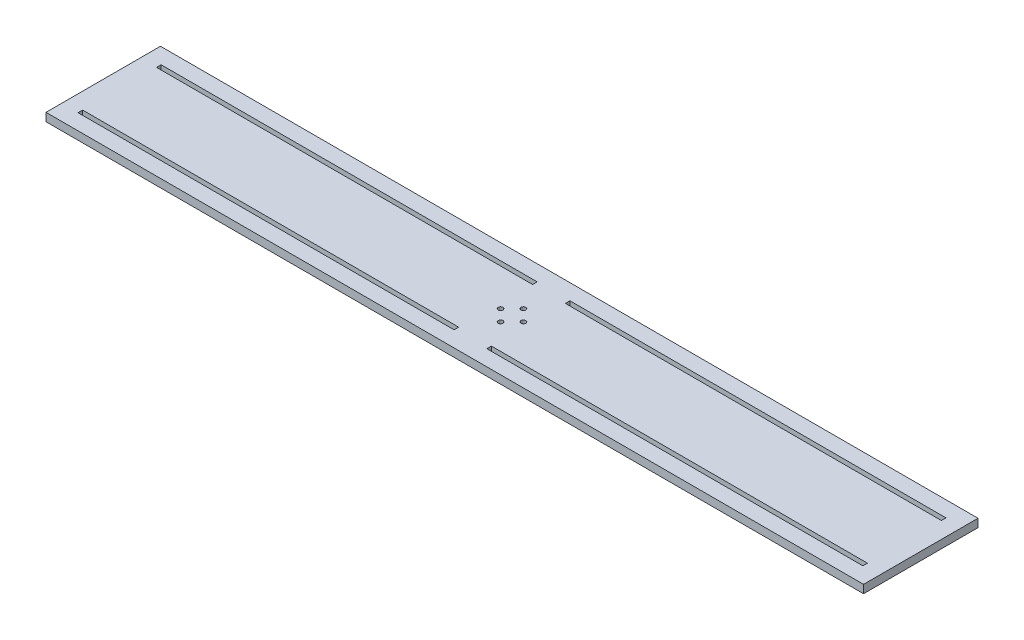
ISO-10303-21;
HEADER;
FILE_DESCRIPTION(('STEP AP214'),'2;1');
FILE_NAME('part.step','',(''),(''),'','','');
FILE_SCHEMA(('AUTOMOTIVE_DESIGN { 1 0 10303 214 1 1 1 1 }'));
ENDSEC;
DATA;
#1=APPLICATION_CONTEXT('core data for automotive mechanical design processes');
#2=APPLICATION_PROTOCOL_DEFINITION('international standard','automotive_design',2000,#1);
#3=PRODUCT_CONTEXT('',#1,'mechanical');
#4=PRODUCT('Part','Part','',(#3));
#5=PRODUCT_RELATED_PRODUCT_CATEGORY('part','',(#4));
#6=PRODUCT_DEFINITION_FORMATION('','',#4);
#7=PRODUCT_DEFINITION_CONTEXT('part definition',#1,'design');
#8=PRODUCT_DEFINITION('design','',#6,#7);
#9=PRODUCT_DEFINITION_SHAPE('','',#8);
#10=(LENGTH_UNIT() NAMED_UNIT(*) SI_UNIT(.MILLI.,.METRE.));
#11=(NAMED_UNIT(*) PLANE_ANGLE_UNIT() SI_UNIT($,.RADIAN.));
#12=(NAMED_UNIT(*) SI_UNIT($,.STERADIAN.) SOLID_ANGLE_UNIT());
#13=UNCERTAINTY_MEASURE_WITH_UNIT(LENGTH_MEASURE(1.E-05),#10,'distance_accuracy_value','');
#14=(GEOMETRIC_REPRESENTATION_CONTEXT(3) GLOBAL_UNCERTAINTY_ASSIGNED_CONTEXT((#13)) GLOBAL_UNIT_ASSIGNED_CONTEXT((#10,
#11,#12)) REPRESENTATION_CONTEXT('',''));
#15=CARTESIAN_POINT('',(0.,0.,0.));
#16=DIRECTION('',(0.,0.,1.));
#17=DIRECTION('',(1.,0.,0.));
#18=AXIS2_PLACEMENT_3D('',#15,#16,#17);
#19=CARTESIAN_POINT('',(0.,2.5,-1131.15981177522));
#20=DIRECTION('',(0.,0.,-1.));
#21=DIRECTION('',(-1.,0.,0.));
#22=AXIS2_PLACEMENT_3D('',#19,#20,#21);
#23=PLANE('',#22);
#24=DIRECTION('',(1.,0.,0.));
#25=VECTOR('',#24,1.);
#26=CARTESIAN_POINT('',(0.,-2.5,-1131.15981177522));
#27=LINE('',#26,#25);
#28=CARTESIAN_POINT('',(147.171720397431,-2.5,-1131.15981177522));
#29=VERTEX_POINT('',#28);
#30=CARTESIAN_POINT('',(647.171720397432,-2.5,-1131.15981177522));
#31=VERTEX_POINT('',#30);
#32=EDGE_CURVE('E262',#29,#31,#27,.T.);
#33=ORIENTED_EDGE('',*,*,#32,.T.);
#34=DIRECTION('',(0.,-1.,0.));
#35=VECTOR('',#34,1.);
#36=CARTESIAN_POINT('',(647.171720397432,2.5,-1131.15981177522));
#37=LINE('',#36,#35);
#38=CARTESIAN_POINT('',(647.171720397432,2.5,-1131.15981177522));
#39=VERTEX_POINT('',#38);
#40=EDGE_CURVE('E11',#39,#31,#37,.T.);
#41=ORIENTED_EDGE('',*,*,#40,.F.);
#42=DIRECTION('',(1.,0.,0.));
#43=VECTOR('',#42,1.);
#44=CARTESIAN_POINT('',(0.,2.5,-1131.15981177522));
#45=LINE('',#44,#43);
#46=CARTESIAN_POINT('',(147.171720397431,2.5,-1131.15981177522));
#47=VERTEX_POINT('',#46);
#48=EDGE_CURVE('E185',#47,#39,#45,.T.);
#49=ORIENTED_EDGE('',*,*,#48,.F.);
#50=DIRECTION('',(0.,-1.,0.));
#51=VECTOR('',#50,1.);
#52=CARTESIAN_POINT('',(147.171720397431,2.5,-1131.15981177522));
#53=LINE('',#52,#51);
#54=EDGE_CURVE('E53',#47,#29,#53,.T.);
#55=ORIENTED_EDGE('',*,*,#54,.T.);
#56=EDGE_LOOP('',(#33,#41,#49,#55));
#57=FACE_BOUND('',#56,.T.);
#58=ADVANCED_FACE('F34',(#57),#23,.F.);
#59=CARTESIAN_POINT('',(647.171720397633,2.5,-1.14960791179474E-10));
#60=DIRECTION('',(-1.,0.,1.77635683940021E-13));
#61=DIRECTION('',(1.77635683940021E-13,0.,1.));
#62=AXIS2_PLACEMENT_3D('',#59,#60,#61);
#63=PLANE('',#62);
#64=DIRECTION('',(-1.77635683940021E-13,0.,-1.));
#65=VECTOR('',#64,1.);
#66=CARTESIAN_POINT('',(647.171720397633,-2.5,-1.14960791179474E-10));
#67=LINE('',#66,#65);
#68=CARTESIAN_POINT('',(647.171720397432,-2.5,-1201.15981177522));
#69=VERTEX_POINT('',#68);
#70=EDGE_CURVE('E191',#31,#69,#67,.T.);
#71=ORIENTED_EDGE('',*,*,#70,.T.);
#72=DIRECTION('',(0.,-1.,0.));
#73=VECTOR('',#72,1.);
#74=CARTESIAN_POINT('',(647.171720397432,2.5,-1201.15981177522));
#75=LINE('',#74,#73);
#76=CARTESIAN_POINT('',(647.171720397432,2.5,-1201.15981177522));
#77=VERTEX_POINT('',#76);
#78=EDGE_CURVE('E44',#77,#69,#75,.T.);
#79=ORIENTED_EDGE('',*,*,#78,.F.);
#80=DIRECTION('',(-1.77635683940021E-13,0.,-1.));
#81=VECTOR('',#80,1.);
#82=CARTESIAN_POINT('',(647.171720397633,2.5,-1.14960791179474E-10));
#83=LINE('',#82,#81);
#84=EDGE_CURVE('E179',#39,#77,#83,.T.);
#85=ORIENTED_EDGE('',*,*,#84,.F.);
#86=ORIENTED_EDGE('',*,*,#40,.T.);
#87=EDGE_LOOP('',(#71,#79,#85,#86));
#88=FACE_BOUND('',#87,.T.);
#89=ADVANCED_FACE('F190',(#88),#63,.F.);
#90=CARTESIAN_POINT('',(0.,2.5,-1201.15981177522));
#91=DIRECTION('',(0.,0.,-1.));
#92=DIRECTION('',(-1.,0.,0.));
#93=AXIS2_PLACEMENT_3D('',#90,#91,#92);
#94=PLANE('',#93);
#95=DIRECTION('',(1.,0.,0.));
#96=VECTOR('',#95,1.);
#97=CARTESIAN_POINT('',(0.,-2.5,-1201.15981177522));
#98=LINE('',#97,#96);
#99=CARTESIAN_POINT('',(147.171720397431,-2.5,-1201.15981177522));
#100=VERTEX_POINT('',#99);
#101=EDGE_CURVE('E265',#100,#69,#98,.T.);
#102=ORIENTED_EDGE('',*,*,#101,.F.);
#103=DIRECTION('',(0.,-1.,0.));
#104=VECTOR('',#103,1.);
#105=CARTESIAN_POINT('',(147.171720397431,2.5,-1201.15981177522));
#106=LINE('',#105,#104);
#107=CARTESIAN_POINT('',(147.171720397431,2.5,-1201.15981177522));
#108=VERTEX_POINT('',#107);
#109=EDGE_CURVE('E115',#108,#100,#106,.T.);
#110=ORIENTED_EDGE('',*,*,#109,.F.);
#111=DIRECTION('',(1.,0.,0.));
#112=VECTOR('',#111,1.);
#113=CARTESIAN_POINT('',(0.,2.5,-1201.15981177522));
#114=LINE('',#113,#112);
#115=EDGE_CURVE('E184',#108,#77,#114,.T.);
#116=ORIENTED_EDGE('',*,*,#115,.T.);
#117=ORIENTED_EDGE('',*,*,#78,.T.);
#118=EDGE_LOOP('',(#102,#110,#116,#117));
#119=FACE_BOUND('',#118,.T.);
#120=ADVANCED_FACE('F195',(#119),#94,.T.);
#121=CARTESIAN_POINT('',(387.171720397431,2.5,0.));
#122=DIRECTION('',(-1.,0.,0.));
#123=DIRECTION('',(0.,0.,1.));
#124=AXIS2_PLACEMENT_3D('',#121,#122,#123);
#125=PLANE('',#124);
#126=DIRECTION('',(0.,0.,-1.));
#127=VECTOR('',#126,1.);
#128=CARTESIAN_POINT('',(387.171720397431,-2.5,0.));
#129=LINE('',#128,#127);
#130=CARTESIAN_POINT('',(387.171720397431,-2.5,-1140.75981177522));
#131=VERTEX_POINT('',#130);
#132=CARTESIAN_POINT('',(387.171720397431,-2.5,-1143.55981177522));
#133=VERTEX_POINT('',#132);
#134=EDGE_CURVE('E250',#131,#133,#129,.T.);
#135=ORIENTED_EDGE('',*,*,#134,.F.);
#136=DIRECTION('',(0.,-1.,0.));
#137=VECTOR('',#136,1.);
#138=CARTESIAN_POINT('',(387.171720397431,2.5,-1140.75981177522));
#139=LINE('',#138,#137);
#140=CARTESIAN_POINT('',(387.171720397431,2.5,-1140.75981177522));
#141=VERTEX_POINT('',#140);
#142=EDGE_CURVE('E272',#141,#131,#139,.T.);
#143=ORIENTED_EDGE('',*,*,#142,.F.);
#144=DIRECTION('',(0.,0.,-1.));
#145=VECTOR('',#144,1.);
#146=CARTESIAN_POINT('',(387.171720397431,2.5,0.));
#147=LINE('',#146,#145);
#148=CARTESIAN_POINT('',(387.171720397431,2.5,-1143.55981177522));
#149=VERTEX_POINT('',#148);
#150=EDGE_CURVE('E618',#141,#149,#147,.T.);
#151=ORIENTED_EDGE('',*,*,#150,.T.);
#152=DIRECTION('',(0.,-1.,0.));
#153=VECTOR('',#152,1.);
#154=CARTESIAN_POINT('',(387.171720397431,2.5,-1143.55981177522));
#155=LINE('',#154,#153);
#156=EDGE_CURVE('E274',#149,#133,#155,.T.);
#157=ORIENTED_EDGE('',*,*,#156,.T.);
#158=EDGE_LOOP('',(#135,#143,#151,#157));
#159=FACE_BOUND('',#158,.T.);
#160=ADVANCED_FACE('F353',(#159),#125,.T.);
#161=CARTESIAN_POINT('',(0.,2.5,-1140.75981177522));
#162=DIRECTION('',(0.,0.,-1.));
#163=DIRECTION('',(-1.,0.,0.));
#164=AXIS2_PLACEMENT_3D('',#161,#162,#163);
#165=PLANE('',#164);
#166=DIRECTION('',(1.,0.,0.));
#167=VECTOR('',#166,1.);
#168=CARTESIAN_POINT('',(0.,-2.5,-1140.75981177522));
#169=LINE('',#168,#167);
#170=CARTESIAN_POINT('',(157.171720397431,-2.5,-1140.75981177522));
#171=VERTEX_POINT('',#170);
#172=EDGE_CURVE('E253',#171,#131,#169,.T.);
#173=ORIENTED_EDGE('',*,*,#172,.F.);
#174=DIRECTION('',(0.,-1.,0.));
#175=VECTOR('',#174,1.);
#176=CARTESIAN_POINT('',(157.171720397431,2.5,-1140.75981177522));
#177=LINE('',#176,#175);
#178=CARTESIAN_POINT('',(157.171720397431,2.5,-1140.75981177522));
#179=VERTEX_POINT('',#178);
#180=EDGE_CURVE('E280',#179,#171,#177,.T.);
#181=ORIENTED_EDGE('',*,*,#180,.F.);
#182=DIRECTION('',(1.,0.,0.));
#183=VECTOR('',#182,1.);
#184=CARTESIAN_POINT('',(0.,2.5,-1140.75981177522));
#185=LINE('',#184,#183);
#186=EDGE_CURVE('E615',#179,#141,#185,.T.);
#187=ORIENTED_EDGE('',*,*,#186,.T.);
#188=ORIENTED_EDGE('',*,*,#142,.T.);
#189=EDGE_LOOP('',(#173,#181,#187,#188));
#190=FACE_BOUND('',#189,.T.);
#191=ADVANCED_FACE('F349',(#190),#165,.T.);
#192=CARTESIAN_POINT('',(157.171720397431,2.5,0.));
#193=DIRECTION('',(-1.,0.,0.));
#194=DIRECTION('',(0.,0.,1.));
#195=AXIS2_PLACEMENT_3D('',#192,#193,#194);
#196=PLANE('',#195);
#197=DIRECTION('',(0.,0.,-1.));
#198=VECTOR('',#197,1.);
#199=CARTESIAN_POINT('',(157.171720397431,-2.5,0.));
#200=LINE('',#199,#198);
#201=CARTESIAN_POINT('',(157.171720397431,-2.5,-1143.55981177522));
#202=VERTEX_POINT('',#201);
#203=EDGE_CURVE('E256',#171,#202,#200,.T.);
#204=ORIENTED_EDGE('',*,*,#203,.T.);
#205=DIRECTION('',(0.,-1.,0.));
#206=VECTOR('',#205,1.);
#207=CARTESIAN_POINT('',(157.171720397431,2.5,-1143.55981177522));
#208=LINE('',#207,#206);
#209=CARTESIAN_POINT('',(157.171720397431,2.5,-1143.55981177522));
#210=VERTEX_POINT('',#209);
#211=EDGE_CURVE('E276',#210,#202,#208,.T.);
#212=ORIENTED_EDGE('',*,*,#211,.F.);
#213=DIRECTION('',(0.,0.,-1.));
#214=VECTOR('',#213,1.);
#215=CARTESIAN_POINT('',(157.171720397431,2.5,0.));
#216=LINE('',#215,#214);
#217=EDGE_CURVE('E610',#179,#210,#216,.T.);
#218=ORIENTED_EDGE('',*,*,#217,.F.);
#219=ORIENTED_EDGE('',*,*,#180,.T.);
#220=EDGE_LOOP('',(#204,#212,#218,#219));
#221=FACE_BOUND('',#220,.T.);
#222=ADVANCED_FACE('F345',(#221),#196,.F.);
#223=CARTESIAN_POINT('',(407.171720397431,2.5,0.));
#224=DIRECTION('',(1.,0.,0.));
#225=DIRECTION('',(0.,0.,-1.));
#226=AXIS2_PLACEMENT_3D('',#223,#224,#225);
#227=PLANE('',#226);
#228=DIRECTION('',(0.,0.,1.));
#229=VECTOR('',#228,1.);
#230=CARTESIAN_POINT('',(407.171720397431,-2.5,0.));
#231=LINE('',#230,#229);
#232=CARTESIAN_POINT('',(407.171720397431,-2.5,-1191.55981177522));
#233=VERTEX_POINT('',#232);
#234=CARTESIAN_POINT('',(407.171720397431,-2.5,-1188.75981177522));
#235=VERTEX_POINT('',#234);
#236=EDGE_CURVE('E238',#233,#235,#231,.T.);
#237=ORIENTED_EDGE('',*,*,#236,.F.);
#238=DIRECTION('',(0.,-1.,0.));
#239=VECTOR('',#238,1.);
#240=CARTESIAN_POINT('',(407.171720397431,2.5,-1191.55981177522));
#241=LINE('',#240,#239);
#242=CARTESIAN_POINT('',(407.171720397431,2.5,-1191.55981177522));
#243=VERTEX_POINT('',#242);
#244=EDGE_CURVE('E277',#243,#233,#241,.T.);
#245=ORIENTED_EDGE('',*,*,#244,.F.);
#246=DIRECTION('',(0.,0.,1.));
#247=VECTOR('',#246,1.);
#248=CARTESIAN_POINT('',(407.171720397431,2.5,0.));
#249=LINE('',#248,#247);
#250=CARTESIAN_POINT('',(407.171720397431,2.5,-1188.75981177522));
#251=VERTEX_POINT('',#250);
#252=EDGE_CURVE('E629',#243,#251,#249,.T.);
#253=ORIENTED_EDGE('',*,*,#252,.T.);
#254=DIRECTION('',(0.,-1.,0.));
#255=VECTOR('',#254,1.);
#256=CARTESIAN_POINT('',(407.171720397431,2.5,-1188.75981177522));
#257=LINE('',#256,#255);
#258=EDGE_CURVE('E283',#251,#235,#257,.T.);
#259=ORIENTED_EDGE('',*,*,#258,.T.);
#260=EDGE_LOOP('',(#237,#245,#253,#259));
#261=FACE_BOUND('',#260,.T.);
#262=ADVANCED_FACE('F348',(#261),#227,.T.);
#263=CARTESIAN_POINT('',(0.,2.5,-1191.55981177522));
#264=DIRECTION('',(0.,0.,-1.));
#265=DIRECTION('',(-1.,0.,0.));
#266=AXIS2_PLACEMENT_3D('',#263,#264,#265);
#267=PLANE('',#266);
#268=DIRECTION('',(1.,0.,0.));
#269=VECTOR('',#268,1.);
#270=CARTESIAN_POINT('',(0.,-2.5,-1191.55981177522));
#271=LINE('',#270,#269);
#272=CARTESIAN_POINT('',(637.171720397431,-2.5,-1191.55981177522));
#273=VERTEX_POINT('',#272);
#274=EDGE_CURVE('E241',#233,#273,#271,.T.);
#275=ORIENTED_EDGE('',*,*,#274,.T.);
#276=DIRECTION('',(0.,-1.,0.));
#277=VECTOR('',#276,1.);
#278=CARTESIAN_POINT('',(637.171720397431,2.5,-1191.55981177522));
#279=LINE('',#278,#277);
#280=CARTESIAN_POINT('',(637.171720397431,2.5,-1191.55981177522));
#281=VERTEX_POINT('',#280);
#282=EDGE_CURVE('E288',#281,#273,#279,.T.);
#283=ORIENTED_EDGE('',*,*,#282,.F.);
#284=DIRECTION('',(1.,0.,0.));
#285=VECTOR('',#284,1.);
#286=CARTESIAN_POINT('',(0.,2.5,-1191.55981177522));
#287=LINE('',#286,#285);
#288=EDGE_CURVE('E626',#243,#281,#287,.T.);
#289=ORIENTED_EDGE('',*,*,#288,.F.);
#290=ORIENTED_EDGE('',*,*,#244,.T.);
#291=EDGE_LOOP('',(#275,#283,#289,#290));
#292=FACE_BOUND('',#291,.T.);
#293=ADVANCED_FACE('F366',(#292),#267,.F.);
#294=CARTESIAN_POINT('',(637.171720397431,2.5,0.));
#295=DIRECTION('',(1.,0.,0.));
#296=DIRECTION('',(0.,0.,-1.));
#297=AXIS2_PLACEMENT_3D('',#294,#295,#296);
#298=PLANE('',#297);
#299=DIRECTION('',(0.,0.,1.));
#300=VECTOR('',#299,1.);
#301=CARTESIAN_POINT('',(637.171720397431,-2.5,0.));
#302=LINE('',#301,#300);
#303=CARTESIAN_POINT('',(637.171720397431,-2.5,-1188.75981177522));
#304=VERTEX_POINT('',#303);
#305=EDGE_CURVE('E244',#273,#304,#302,.T.);
#306=ORIENTED_EDGE('',*,*,#305,.T.);
#307=DIRECTION('',(0.,-1.,0.));
#308=VECTOR('',#307,1.);
#309=CARTESIAN_POINT('',(637.171720397431,2.5,-1188.75981177522));
#310=LINE('',#309,#308);
#311=CARTESIAN_POINT('',(637.171720397431,2.5,-1188.75981177522));
#312=VERTEX_POINT('',#311);
#313=EDGE_CURVE('E285',#312,#304,#310,.T.);
#314=ORIENTED_EDGE('',*,*,#313,.F.);
#315=DIRECTION('',(0.,0.,1.));
#316=VECTOR('',#315,1.);
#317=CARTESIAN_POINT('',(637.171720397431,2.5,0.));
#318=LINE('',#317,#316);
#319=EDGE_CURVE('E624',#281,#312,#318,.T.);
#320=ORIENTED_EDGE('',*,*,#319,.F.);
#321=ORIENTED_EDGE('',*,*,#282,.T.);
#322=EDGE_LOOP('',(#306,#314,#320,#321));
#323=FACE_BOUND('',#322,.T.);
#324=ADVANCED_FACE('F362',(#323),#298,.F.);
#325=CARTESIAN_POINT('',(0.,2.5,-1191.55981177522));
#326=DIRECTION('',(0.,0.,-1.));
#327=DIRECTION('',(-1.,0.,0.));
#328=AXIS2_PLACEMENT_3D('',#325,#326,#327);
#329=PLANE('',#328);
#330=DIRECTION('',(1.,0.,0.));
#331=VECTOR('',#330,1.);
#332=CARTESIAN_POINT('',(0.,-2.5,-1191.55981177522));
#333=LINE('',#332,#331);
#334=CARTESIAN_POINT('',(157.171720397431,-2.5,-1191.55981177522));
#335=VERTEX_POINT('',#334);
#336=CARTESIAN_POINT('',(387.171720397431,-2.5,-1191.55981177522));
#337=VERTEX_POINT('',#336);
#338=EDGE_CURVE('E226',#335,#337,#333,.T.);
#339=ORIENTED_EDGE('',*,*,#338,.T.);
#340=DIRECTION('',(0.,-1.,0.));
#341=VECTOR('',#340,1.);
#342=CARTESIAN_POINT('',(387.171720397431,2.5,-1191.55981177522));
#343=LINE('',#342,#341);
#344=CARTESIAN_POINT('',(387.171720397431,2.5,-1191.55981177522));
#345=VERTEX_POINT('',#344);
#346=EDGE_CURVE('E286',#345,#337,#343,.T.);
#347=ORIENTED_EDGE('',*,*,#346,.F.);
#348=DIRECTION('',(1.,0.,0.));
#349=VECTOR('',#348,1.);
#350=CARTESIAN_POINT('',(0.,2.5,-1191.55981177522));
#351=LINE('',#350,#349);
#352=CARTESIAN_POINT('',(157.171720397431,2.5,-1191.55981177522));
#353=VERTEX_POINT('',#352);
#354=EDGE_CURVE('E640',#353,#345,#351,.T.);
#355=ORIENTED_EDGE('',*,*,#354,.F.);
#356=DIRECTION('',(0.,-1.,0.));
#357=VECTOR('',#356,1.);
#358=CARTESIAN_POINT('',(157.171720397431,2.5,-1191.55981177522));
#359=LINE('',#358,#357);
#360=EDGE_CURVE('E292',#353,#335,#359,.T.);
#361=ORIENTED_EDGE('',*,*,#360,.T.);
#362=EDGE_LOOP('',(#339,#347,#355,#361));
#363=FACE_BOUND('',#362,.T.);
#364=ADVANCED_FACE('F365',(#363),#329,.F.);
#365=CARTESIAN_POINT('',(387.171720397431,2.5,0.));
#366=DIRECTION('',(1.,0.,0.));
#367=DIRECTION('',(0.,0.,-1.));
#368=AXIS2_PLACEMENT_3D('',#365,#366,#367);
#369=PLANE('',#368);
#370=DIRECTION('',(0.,0.,1.));
#371=VECTOR('',#370,1.);
#372=CARTESIAN_POINT('',(387.171720397431,-2.5,0.));
#373=LINE('',#372,#371);
#374=CARTESIAN_POINT('',(387.171720397431,-2.5,-1188.75981177522));
#375=VERTEX_POINT('',#374);
#376=EDGE_CURVE('E229',#337,#375,#373,.T.);
#377=ORIENTED_EDGE('',*,*,#376,.T.);
#378=DIRECTION('',(0.,-1.,0.));
#379=VECTOR('',#378,1.);
#380=CARTESIAN_POINT('',(387.171720397431,2.5,-1188.75981177522));
#381=LINE('',#380,#379);
#382=CARTESIAN_POINT('',(387.171720397431,2.5,-1188.75981177522));
#383=VERTEX_POINT('',#382);
#384=EDGE_CURVE('E296',#383,#375,#381,.T.);
#385=ORIENTED_EDGE('',*,*,#384,.F.);
#386=DIRECTION('',(0.,0.,1.));
#387=VECTOR('',#386,1.);
#388=CARTESIAN_POINT('',(387.171720397431,2.5,0.));
#389=LINE('',#388,#387);
#390=EDGE_CURVE('E638',#345,#383,#389,.T.);
#391=ORIENTED_EDGE('',*,*,#390,.F.);
#392=ORIENTED_EDGE('',*,*,#346,.T.);
#393=EDGE_LOOP('',(#377,#385,#391,#392));
#394=FACE_BOUND('',#393,.T.);
#395=ADVANCED_FACE('F380',(#394),#369,.F.);
#396=CARTESIAN_POINT('',(0.,2.5,-1188.75981177522));
#397=DIRECTION('',(0.,0.,-1.));
#398=DIRECTION('',(-1.,0.,0.));
#399=AXIS2_PLACEMENT_3D('',#396,#397,#398);
#400=PLANE('',#399);
#401=DIRECTION('',(1.,0.,0.));
#402=VECTOR('',#401,1.);
#403=CARTESIAN_POINT('',(0.,-2.5,-1188.75981177522));
#404=LINE('',#403,#402);
#405=CARTESIAN_POINT('',(157.171720397431,-2.5,-1188.75981177522));
#406=VERTEX_POINT('',#405);
#407=EDGE_CURVE('E232',#406,#375,#404,.T.);
#408=ORIENTED_EDGE('',*,*,#407,.F.);
#409=DIRECTION('',(0.,-1.,0.));
#410=VECTOR('',#409,1.);
#411=CARTESIAN_POINT('',(157.171720397431,2.5,-1188.75981177522));
#412=LINE('',#411,#410);
#413=CARTESIAN_POINT('',(157.171720397431,2.5,-1188.75981177522));
#414=VERTEX_POINT('',#413);
#415=EDGE_CURVE('E294',#414,#406,#412,.T.);
#416=ORIENTED_EDGE('',*,*,#415,.F.);
#417=DIRECTION('',(1.,0.,0.));
#418=VECTOR('',#417,1.);
#419=CARTESIAN_POINT('',(0.,2.5,-1188.75981177522));
#420=LINE('',#419,#418);
#421=EDGE_CURVE('E635',#414,#383,#420,.T.);
#422=ORIENTED_EDGE('',*,*,#421,.T.);
#423=ORIENTED_EDGE('',*,*,#384,.T.);
#424=EDGE_LOOP('',(#408,#416,#422,#423));
#425=FACE_BOUND('',#424,.T.);
#426=ADVANCED_FACE('F377',(#425),#400,.T.);
#427=CARTESIAN_POINT('',(0.,2.5,-1140.75981177522));
#428=DIRECTION('',(0.,0.,-1.));
#429=DIRECTION('',(-1.,0.,0.));
#430=AXIS2_PLACEMENT_3D('',#427,#428,#429);
#431=PLANE('',#430);
#432=DIRECTION('',(1.,0.,0.));
#433=VECTOR('',#432,1.);
#434=CARTESIAN_POINT('',(0.,-2.5,-1140.75981177522));
#435=LINE('',#434,#433);
#436=CARTESIAN_POINT('',(407.171720397431,-2.5,-1140.75981177522));
#437=VERTEX_POINT('',#436);
#438=CARTESIAN_POINT('',(637.171720397431,-2.5,-1140.75981177522));
#439=VERTEX_POINT('',#438);
#440=EDGE_CURVE('E214',#437,#439,#435,.T.);
#441=ORIENTED_EDGE('',*,*,#440,.F.);
#442=DIRECTION('',(0.,-1.,0.));
#443=VECTOR('',#442,1.);
#444=CARTESIAN_POINT('',(407.171720397431,2.5,-1140.75981177522));
#445=LINE('',#444,#443);
#446=CARTESIAN_POINT('',(407.171720397431,2.5,-1140.75981177522));
#447=VERTEX_POINT('',#446);
#448=EDGE_CURVE('E38',#447,#437,#445,.T.);
#449=ORIENTED_EDGE('',*,*,#448,.F.);
#450=DIRECTION('',(1.,0.,0.));
#451=VECTOR('',#450,1.);
#452=CARTESIAN_POINT('',(0.,2.5,-1140.75981177522));
#453=LINE('',#452,#451);
#454=CARTESIAN_POINT('',(637.171720397431,2.5,-1140.75981177522));
#455=VERTEX_POINT('',#454);
#456=EDGE_CURVE('E317',#447,#455,#453,.T.);
#457=ORIENTED_EDGE('',*,*,#456,.T.);
#458=DIRECTION('',(0.,-1.,0.));
#459=VECTOR('',#458,1.);
#460=CARTESIAN_POINT('',(637.171720397431,2.5,-1140.75981177522));
#461=LINE('',#460,#459);
#462=EDGE_CURVE('E198',#455,#439,#461,.T.);
#463=ORIENTED_EDGE('',*,*,#462,.T.);
#464=EDGE_LOOP('',(#441,#449,#457,#463));
#465=FACE_BOUND('',#464,.T.);
#466=ADVANCED_FACE('F316',(#465),#431,.T.);
#467=CARTESIAN_POINT('',(407.171720397431,2.5,0.));
#468=DIRECTION('',(-1.,0.,0.));
#469=DIRECTION('',(0.,0.,1.));
#470=AXIS2_PLACEMENT_3D('',#467,#468,#469);
#471=PLANE('',#470);
#472=DIRECTION('',(0.,0.,-1.));
#473=VECTOR('',#472,1.);
#474=CARTESIAN_POINT('',(407.171720397431,-2.5,0.));
#475=LINE('',#474,#473);
#476=CARTESIAN_POINT('',(407.171720397431,-2.5,-1143.55981177522));
#477=VERTEX_POINT('',#476);
#478=EDGE_CURVE('E217',#437,#477,#475,.T.);
#479=ORIENTED_EDGE('',*,*,#478,.T.);
#480=DIRECTION('',(0.,-1.,0.));
#481=VECTOR('',#480,1.);
#482=CARTESIAN_POINT('',(407.171720397431,2.5,-1143.55981177522));
#483=LINE('',#482,#481);
#484=CARTESIAN_POINT('',(407.171720397431,2.5,-1143.55981177522));
#485=VERTEX_POINT('',#484);
#486=EDGE_CURVE('E302',#485,#477,#483,.T.);
#487=ORIENTED_EDGE('',*,*,#486,.F.);
#488=DIRECTION('',(0.,0.,-1.));
#489=VECTOR('',#488,1.);
#490=CARTESIAN_POINT('',(407.171720397431,2.5,0.));
#491=LINE('',#490,#489);
#492=EDGE_CURVE('E310',#447,#485,#491,.T.);
#493=ORIENTED_EDGE('',*,*,#492,.F.);
#494=ORIENTED_EDGE('',*,*,#448,.T.);
#495=EDGE_LOOP('',(#479,#487,#493,#494));
#496=FACE_BOUND('',#495,.T.);
#497=ADVANCED_FACE('F308',(#496),#471,.F.);
#498=CARTESIAN_POINT('',(0.,2.5,-1143.55981177522));
#499=DIRECTION('',(0.,0.,-1.));
#500=DIRECTION('',(-1.,0.,0.));
#501=AXIS2_PLACEMENT_3D('',#498,#499,#500);
#502=PLANE('',#501);
#503=DIRECTION('',(1.,0.,0.));
#504=VECTOR('',#503,1.);
#505=CARTESIAN_POINT('',(0.,-2.5,-1143.55981177522));
#506=LINE('',#505,#504);
#507=CARTESIAN_POINT('',(637.171720397431,-2.5,-1143.55981177522));
#508=VERTEX_POINT('',#507);
#509=EDGE_CURVE('E220',#477,#508,#506,.T.);
#510=ORIENTED_EDGE('',*,*,#509,.T.);
#511=DIRECTION('',(0.,-1.,0.));
#512=VECTOR('',#511,1.);
#513=CARTESIAN_POINT('',(637.171720397431,2.5,-1143.55981177522));
#514=LINE('',#513,#512);
#515=CARTESIAN_POINT('',(637.171720397431,2.5,-1143.55981177522));
#516=VERTEX_POINT('',#515);
#517=EDGE_CURVE('E301',#516,#508,#514,.T.);
#518=ORIENTED_EDGE('',*,*,#517,.F.);
#519=DIRECTION('',(1.,0.,0.));
#520=VECTOR('',#519,1.);
#521=CARTESIAN_POINT('',(0.,2.5,-1143.55981177522));
#522=LINE('',#521,#520);
#523=EDGE_CURVE('E644',#485,#516,#522,.T.);
#524=ORIENTED_EDGE('',*,*,#523,.F.);
#525=ORIENTED_EDGE('',*,*,#486,.T.);
#526=EDGE_LOOP('',(#510,#518,#524,#525));
#527=FACE_BOUND('',#526,.T.);
#528=ADVANCED_FACE('F324',(#527),#502,.F.);
#529=CARTESIAN_POINT('',(0.,2.5,-1143.55981177522));
#530=DIRECTION('',(0.,0.,-1.));
#531=DIRECTION('',(-1.,0.,0.));
#532=AXIS2_PLACEMENT_3D('',#529,#530,#531);
#533=PLANE('',#532);
#534=DIRECTION('',(1.,0.,0.));
#535=VECTOR('',#534,1.);
#536=CARTESIAN_POINT('',(0.,-2.5,-1143.55981177522));
#537=LINE('',#536,#535);
#538=EDGE_CURVE('E259',#202,#133,#537,.T.);
#539=ORIENTED_EDGE('',*,*,#538,.T.);
#540=ORIENTED_EDGE('',*,*,#156,.F.);
#541=DIRECTION('',(1.,0.,0.));
#542=VECTOR('',#541,1.);
#543=CARTESIAN_POINT('',(0.,2.5,-1143.55981177522));
#544=LINE('',#543,#542);
#545=EDGE_CURVE('E609',#210,#149,#544,.T.);
#546=ORIENTED_EDGE('',*,*,#545,.F.);
#547=ORIENTED_EDGE('',*,*,#211,.T.);
#548=EDGE_LOOP('',(#539,#540,#546,#547));
#549=FACE_BOUND('',#548,.T.);
#550=ADVANCED_FACE('F326',(#549),#533,.F.);
#551=CARTESIAN_POINT('',(0.,2.5,-1188.75981177522));
#552=DIRECTION('',(0.,0.,-1.));
#553=DIRECTION('',(-1.,0.,0.));
#554=AXIS2_PLACEMENT_3D('',#551,#552,#553);
#555=PLANE('',#554);
#556=DIRECTION('',(1.,0.,0.));
#557=VECTOR('',#556,1.);
#558=CARTESIAN_POINT('',(0.,-2.5,-1188.75981177522));
#559=LINE('',#558,#557);
#560=EDGE_CURVE('E247',#235,#304,#559,.T.);
#561=ORIENTED_EDGE('',*,*,#560,.F.);
#562=ORIENTED_EDGE('',*,*,#258,.F.);
#563=DIRECTION('',(1.,0.,0.));
#564=VECTOR('',#563,1.);
#565=CARTESIAN_POINT('',(0.,2.5,-1188.75981177522));
#566=LINE('',#565,#564);
#567=EDGE_CURVE('E621',#251,#312,#566,.T.);
#568=ORIENTED_EDGE('',*,*,#567,.T.);
#569=ORIENTED_EDGE('',*,*,#313,.T.);
#570=EDGE_LOOP('',(#561,#562,#568,#569));
#571=FACE_BOUND('',#570,.T.);
#572=ADVANCED_FACE('F332',(#571),#555,.T.);
#573=CARTESIAN_POINT('',(157.171720397431,2.5,0.));
#574=DIRECTION('',(1.,0.,0.));
#575=DIRECTION('',(0.,0.,-1.));
#576=AXIS2_PLACEMENT_3D('',#573,#574,#575);
#577=PLANE('',#576);
#578=DIRECTION('',(0.,0.,1.));
#579=VECTOR('',#578,1.);
#580=CARTESIAN_POINT('',(157.171720397431,-2.5,0.));
#581=LINE('',#580,#579);
#582=EDGE_CURVE('E235',#335,#406,#581,.T.);
#583=ORIENTED_EDGE('',*,*,#582,.F.);
#584=ORIENTED_EDGE('',*,*,#360,.F.);
#585=DIRECTION('',(0.,0.,1.));
#586=VECTOR('',#585,1.);
#587=CARTESIAN_POINT('',(157.171720397431,2.5,0.));
#588=LINE('',#587,#586);
#589=EDGE_CURVE('E632',#353,#414,#588,.T.);
#590=ORIENTED_EDGE('',*,*,#589,.T.);
#591=ORIENTED_EDGE('',*,*,#415,.T.);
#592=EDGE_LOOP('',(#583,#584,#590,#591));
#593=FACE_BOUND('',#592,.T.);
#594=ADVANCED_FACE('F360',(#593),#577,.T.);
#595=CARTESIAN_POINT('',(637.171720397431,2.5,0.));
#596=DIRECTION('',(-1.,0.,0.));
#597=DIRECTION('',(0.,0.,1.));
#598=AXIS2_PLACEMENT_3D('',#595,#596,#597);
#599=PLANE('',#598);
#600=DIRECTION('',(0.,0.,-1.));
#601=VECTOR('',#600,1.);
#602=CARTESIAN_POINT('',(637.171720397431,-2.5,0.));
#603=LINE('',#602,#601);
#604=EDGE_CURVE('E223',#439,#508,#603,.T.);
#605=ORIENTED_EDGE('',*,*,#604,.F.);
#606=ORIENTED_EDGE('',*,*,#462,.F.);
#607=DIRECTION('',(0.,0.,-1.));
#608=VECTOR('',#607,1.);
#609=CARTESIAN_POINT('',(637.171720397431,2.5,0.));
#610=LINE('',#609,#608);
#611=EDGE_CURVE('E322',#455,#516,#610,.T.);
#612=ORIENTED_EDGE('',*,*,#611,.T.);
#613=ORIENTED_EDGE('',*,*,#517,.T.);
#614=EDGE_LOOP('',(#605,#606,#612,#613));
#615=FACE_BOUND('',#614,.T.);
#616=ADVANCED_FACE('F321',(#615),#599,.T.);
#617=CARTESIAN_POINT('',(404.171720397432,2.5,-1166.15981177522));
#618=DIRECTION('',(0.,-1.,0.));
#619=DIRECTION('',(0.,0.,-1.));
#620=AXIS2_PLACEMENT_3D('',#617,#618,#619);
#621=CYLINDRICAL_SURFACE('',#620,1.45000000000017);
#622=CARTESIAN_POINT('',(404.171720397432,2.5,-1166.15981177522));
#623=DIRECTION('',(0.,1.,0.));
#624=DIRECTION('',(0.,0.,1.));
#625=AXIS2_PLACEMENT_3D('',#622,#623,#624);
#626=CIRCLE('',#625,1.45000000000017);
#627=CARTESIAN_POINT('',(404.171720397432,2.5,-1164.70981177522));
#628=VERTEX_POINT('',#627);
#629=EDGE_CURVE('E648',#628,#628,#626,.T.);
#630=ORIENTED_EDGE('',*,*,#629,.T.);
#631=EDGE_LOOP('',(#630));
#632=FACE_BOUND('',#631,.T.);
#633=CARTESIAN_POINT('',(404.171720397432,-2.5,-1166.15981177522));
#634=DIRECTION('',(0.,1.,0.));
#635=DIRECTION('',(0.,0.,1.));
#636=AXIS2_PLACEMENT_3D('',#633,#634,#635);
#637=CIRCLE('',#636,1.45000000000017);
#638=CARTESIAN_POINT('',(404.171720397432,-2.5,-1164.70981177522));
#639=VERTEX_POINT('',#638);
#640=EDGE_CURVE('E211',#639,#639,#637,.T.);
#641=ORIENTED_EDGE('',*,*,#640,.F.);
#642=EDGE_LOOP('',(#641));
#643=FACE_BOUND('',#642,.T.);
#644=ADVANCED_FACE('F388',(#632,#643),#621,.F.);
#645=CARTESIAN_POINT('',(397.171720397432,2.5,-1173.15981177522));
#646=DIRECTION('',(0.,-1.,0.));
#647=DIRECTION('',(0.,0.,-1.));
#648=AXIS2_PLACEMENT_3D('',#645,#646,#647);
#649=CYLINDRICAL_SURFACE('',#648,1.45000000000017);
#650=CARTESIAN_POINT('',(397.171720397432,2.5,-1173.15981177522));
#651=DIRECTION('',(0.,1.,0.));
#652=DIRECTION('',(0.,0.,1.));
#653=AXIS2_PLACEMENT_3D('',#650,#651,#652);
#654=CIRCLE('',#653,1.45000000000017);
#655=CARTESIAN_POINT('',(397.171720397432,2.5,-1171.70981177522));
#656=VERTEX_POINT('',#655);
#657=EDGE_CURVE('E650',#656,#656,#654,.T.);
#658=ORIENTED_EDGE('',*,*,#657,.T.);
#659=EDGE_LOOP('',(#658));
#660=FACE_BOUND('',#659,.T.);
#661=CARTESIAN_POINT('',(397.171720397432,-2.5,-1173.15981177522));
#662=DIRECTION('',(0.,1.,0.));
#663=DIRECTION('',(0.,0.,1.));
#664=AXIS2_PLACEMENT_3D('',#661,#662,#663);
#665=CIRCLE('',#664,1.45000000000017);
#666=CARTESIAN_POINT('',(397.171720397432,-2.5,-1171.70981177522));
#667=VERTEX_POINT('',#666);
#668=EDGE_CURVE('E208',#667,#667,#665,.T.);
#669=ORIENTED_EDGE('',*,*,#668,.F.);
#670=EDGE_LOOP('',(#669));
#671=FACE_BOUND('',#670,.T.);
#672=ADVANCED_FACE('F392',(#660,#671),#649,.F.);
#673=CARTESIAN_POINT('',(390.171720397432,2.5,-1166.15981177522));
#674=DIRECTION('',(0.,-1.,0.));
#675=DIRECTION('',(0.,0.,-1.));
#676=AXIS2_PLACEMENT_3D('',#673,#674,#675);
#677=CYLINDRICAL_SURFACE('',#676,1.44999999999973);
#678=CARTESIAN_POINT('',(390.171720397432,2.5,-1166.15981177522));
#679=DIRECTION('',(0.,1.,0.));
#680=DIRECTION('',(0.,0.,1.));
#681=AXIS2_PLACEMENT_3D('',#678,#679,#680);
#682=CIRCLE('',#681,1.44999999999973);
#683=CARTESIAN_POINT('',(390.171720397432,2.5,-1164.70981177522));
#684=VERTEX_POINT('',#683);
#685=EDGE_CURVE('E414',#684,#684,#682,.T.);
#686=ORIENTED_EDGE('',*,*,#685,.T.);
#687=EDGE_LOOP('',(#686));
#688=FACE_BOUND('',#687,.T.);
#689=CARTESIAN_POINT('',(390.171720397432,-2.5,-1166.15981177522));
#690=DIRECTION('',(0.,1.,0.));
#691=DIRECTION('',(0.,0.,1.));
#692=AXIS2_PLACEMENT_3D('',#689,#690,#691);
#693=CIRCLE('',#692,1.44999999999973);
#694=CARTESIAN_POINT('',(390.171720397432,-2.5,-1164.70981177522));
#695=VERTEX_POINT('',#694);
#696=EDGE_CURVE('E205',#695,#695,#693,.T.);
#697=ORIENTED_EDGE('',*,*,#696,.F.);
#698=EDGE_LOOP('',(#697));
#699=FACE_BOUND('',#698,.T.);
#700=ADVANCED_FACE('F398',(#688,#699),#677,.F.);
#701=CARTESIAN_POINT('',(397.171720397431,2.5,-1159.15981177522));
#702=DIRECTION('',(0.,-1.,0.));
#703=DIRECTION('',(0.,0.,-1.));
#704=AXIS2_PLACEMENT_3D('',#701,#702,#703);
#705=CYLINDRICAL_SURFACE('',#704,1.44999999999973);
#706=CARTESIAN_POINT('',(397.171720397431,2.5,-1159.15981177522));
#707=DIRECTION('',(0.,1.,0.));
#708=DIRECTION('',(0.,0.,1.));
#709=AXIS2_PLACEMENT_3D('',#706,#707,#708);
#710=CIRCLE('',#709,1.44999999999973);
#711=CARTESIAN_POINT('',(397.171720397431,2.5,-1157.70981177522));
#712=VERTEX_POINT('',#711);
#713=EDGE_CURVE('E270',#712,#712,#710,.T.);
#714=ORIENTED_EDGE('',*,*,#713,.T.);
#715=EDGE_LOOP('',(#714));
#716=FACE_BOUND('',#715,.T.);
#717=CARTESIAN_POINT('',(397.171720397431,-2.5,-1159.15981177522));
#718=DIRECTION('',(0.,1.,0.));
#719=DIRECTION('',(0.,0.,1.));
#720=AXIS2_PLACEMENT_3D('',#717,#718,#719);
#721=CIRCLE('',#720,1.44999999999973);
#722=CARTESIAN_POINT('',(397.171720397431,-2.5,-1157.70981177522));
#723=VERTEX_POINT('',#722);
#724=EDGE_CURVE('E202',#723,#723,#721,.T.);
#725=ORIENTED_EDGE('',*,*,#724,.F.);
#726=EDGE_LOOP('',(#725));
#727=FACE_BOUND('',#726,.T.);
#728=ADVANCED_FACE('F36',(#716,#727),#705,.F.);
#729=CARTESIAN_POINT('',(147.171720397431,2.5,0.));
#730=DIRECTION('',(-1.,0.,0.));
#731=DIRECTION('',(0.,0.,1.));
#732=AXIS2_PLACEMENT_3D('',#729,#730,#731);
#733=PLANE('',#732);
#734=DIRECTION('',(0.,0.,-1.));
#735=VECTOR('',#734,1.);
#736=CARTESIAN_POINT('',(147.171720397431,-2.5,0.));
#737=LINE('',#736,#735);
#738=EDGE_CURVE('E267',#29,#100,#737,.T.);
#739=ORIENTED_EDGE('',*,*,#738,.F.);
#740=ORIENTED_EDGE('',*,*,#54,.F.);
#741=DIRECTION('',(0.,0.,-1.));
#742=VECTOR('',#741,1.);
#743=CARTESIAN_POINT('',(147.171720397431,2.5,0.));
#744=LINE('',#743,#742);
#745=EDGE_CURVE('E196',#47,#108,#744,.T.);
#746=ORIENTED_EDGE('',*,*,#745,.T.);
#747=ORIENTED_EDGE('',*,*,#109,.T.);
#748=EDGE_LOOP('',(#739,#740,#746,#747));
#749=FACE_BOUND('',#748,.T.);
#750=ADVANCED_FACE('F409',(#749),#733,.T.);
#751=CARTESIAN_POINT('',(0.,2.5,0.));
#752=DIRECTION('',(0.,1.,0.));
#753=DIRECTION('',(0.,0.,1.));
#754=AXIS2_PLACEMENT_3D('',#751,#752,#753);
#755=PLANE('',#754);
#756=ORIENTED_EDGE('',*,*,#713,.F.);
#757=EDGE_LOOP('',(#756));
#758=FACE_BOUND('',#757,.T.);
#759=ORIENTED_EDGE('',*,*,#685,.F.);
#760=EDGE_LOOP('',(#759));
#761=FACE_BOUND('',#760,.T.);
#762=ORIENTED_EDGE('',*,*,#657,.F.);
#763=EDGE_LOOP('',(#762));
#764=FACE_BOUND('',#763,.T.);
#765=ORIENTED_EDGE('',*,*,#629,.F.);
#766=EDGE_LOOP('',(#765));
#767=FACE_BOUND('',#766,.T.);
#768=ORIENTED_EDGE('',*,*,#456,.F.);
#769=ORIENTED_EDGE('',*,*,#492,.T.);
#770=ORIENTED_EDGE('',*,*,#523,.T.);
#771=ORIENTED_EDGE('',*,*,#611,.F.);
#772=EDGE_LOOP('',(#768,#769,#770,#771));
#773=FACE_BOUND('',#772,.T.);
#774=ORIENTED_EDGE('',*,*,#354,.T.);
#775=ORIENTED_EDGE('',*,*,#390,.T.);
#776=ORIENTED_EDGE('',*,*,#421,.F.);
#777=ORIENTED_EDGE('',*,*,#589,.F.);
#778=EDGE_LOOP('',(#774,#775,#776,#777));
#779=FACE_BOUND('',#778,.T.);
#780=ORIENTED_EDGE('',*,*,#252,.F.);
#781=ORIENTED_EDGE('',*,*,#288,.T.);
#782=ORIENTED_EDGE('',*,*,#319,.T.);
#783=ORIENTED_EDGE('',*,*,#567,.F.);
#784=EDGE_LOOP('',(#780,#781,#782,#783));
#785=FACE_BOUND('',#784,.T.);
#786=ORIENTED_EDGE('',*,*,#150,.F.);
#787=ORIENTED_EDGE('',*,*,#186,.F.);
#788=ORIENTED_EDGE('',*,*,#217,.T.);
#789=ORIENTED_EDGE('',*,*,#545,.T.);
#790=EDGE_LOOP('',(#786,#787,#788,#789));
#791=FACE_BOUND('',#790,.T.);
#792=ORIENTED_EDGE('',*,*,#48,.T.);
#793=ORIENTED_EDGE('',*,*,#84,.T.);
#794=ORIENTED_EDGE('',*,*,#115,.F.);
#795=ORIENTED_EDGE('',*,*,#745,.F.);
#796=EDGE_LOOP('',(#792,#793,#794,#795));
#797=FACE_BOUND('',#796,.T.);
#798=ADVANCED_FACE('F181',(#758,#761,#764,#767,#773,#779,#785,#791,#797),#755,.T.);
#799=CARTESIAN_POINT('',(0.,-2.5,0.));
#800=DIRECTION('',(0.,1.,0.));
#801=DIRECTION('',(0.,0.,1.));
#802=AXIS2_PLACEMENT_3D('',#799,#800,#801);
#803=PLANE('',#802);
#804=ORIENTED_EDGE('',*,*,#724,.T.);
#805=EDGE_LOOP('',(#804));
#806=FACE_BOUND('',#805,.T.);
#807=ORIENTED_EDGE('',*,*,#696,.T.);
#808=EDGE_LOOP('',(#807));
#809=FACE_BOUND('',#808,.T.);
#810=ORIENTED_EDGE('',*,*,#668,.T.);
#811=EDGE_LOOP('',(#810));
#812=FACE_BOUND('',#811,.T.);
#813=ORIENTED_EDGE('',*,*,#640,.T.);
#814=EDGE_LOOP('',(#813));
#815=FACE_BOUND('',#814,.T.);
#816=ORIENTED_EDGE('',*,*,#440,.T.);
#817=ORIENTED_EDGE('',*,*,#604,.T.);
#818=ORIENTED_EDGE('',*,*,#509,.F.);
#819=ORIENTED_EDGE('',*,*,#478,.F.);
#820=EDGE_LOOP('',(#816,#817,#818,#819));
#821=FACE_BOUND('',#820,.T.);
#822=ORIENTED_EDGE('',*,*,#338,.F.);
#823=ORIENTED_EDGE('',*,*,#582,.T.);
#824=ORIENTED_EDGE('',*,*,#407,.T.);
#825=ORIENTED_EDGE('',*,*,#376,.F.);
#826=EDGE_LOOP('',(#822,#823,#824,#825));
#827=FACE_BOUND('',#826,.T.);
#828=ORIENTED_EDGE('',*,*,#236,.T.);
#829=ORIENTED_EDGE('',*,*,#560,.T.);
#830=ORIENTED_EDGE('',*,*,#305,.F.);
#831=ORIENTED_EDGE('',*,*,#274,.F.);
#832=EDGE_LOOP('',(#828,#829,#830,#831));
#833=FACE_BOUND('',#832,.T.);
#834=ORIENTED_EDGE('',*,*,#134,.T.);
#835=ORIENTED_EDGE('',*,*,#538,.F.);
#836=ORIENTED_EDGE('',*,*,#203,.F.);
#837=ORIENTED_EDGE('',*,*,#172,.T.);
#838=EDGE_LOOP('',(#834,#835,#836,#837));
#839=FACE_BOUND('',#838,.T.);
#840=ORIENTED_EDGE('',*,*,#32,.F.);
#841=ORIENTED_EDGE('',*,*,#738,.T.);
#842=ORIENTED_EDGE('',*,*,#101,.T.);
#843=ORIENTED_EDGE('',*,*,#70,.F.);
#844=EDGE_LOOP('',(#840,#841,#842,#843));
#845=FACE_BOUND('',#844,.T.);
#846=ADVANCED_FACE('F313',(#806,#809,#812,#815,#821,#827,#833,#839,#845),#803,.F.);
#847=CLOSED_SHELL('',(#58,#89,#120,#160,#191,#222,#262,#293,#324,#364,#395,#426,#466,#497,#528,
#550,#572,#594,#616,#644,#672,#700,#728,#750,#798,#846));
#848=MANIFOLD_SOLID_BREP('B2',#847);
#849=ADVANCED_BREP_SHAPE_REPRESENTATION('',(#18,#848),#14);
#850=SHAPE_DEFINITION_REPRESENTATION(#9,#849);
ENDSEC;
END-ISO-10303-21;
